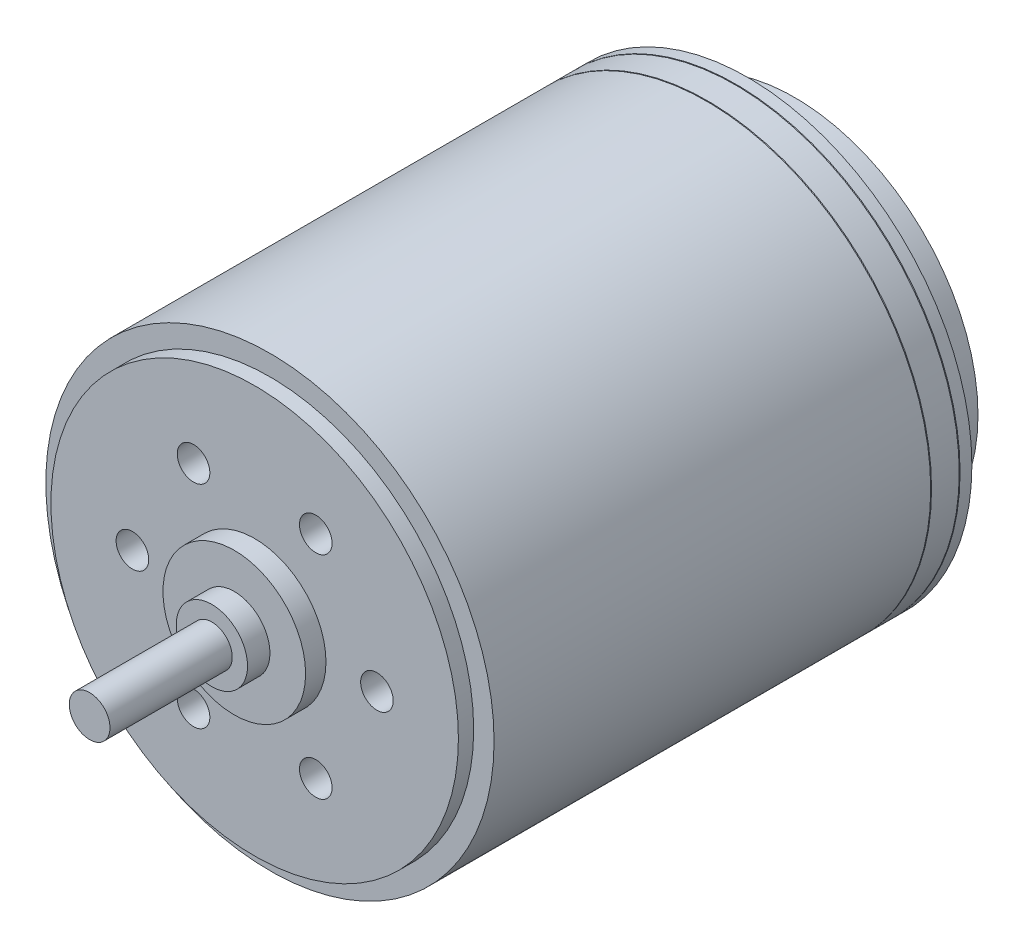
ISO-10303-21;
HEADER;
FILE_DESCRIPTION(('STEP AP214'),'2;1');
FILE_NAME('part.step','',(''),(''),'','','');
FILE_SCHEMA(('AUTOMOTIVE_DESIGN { 1 0 10303 214 1 1 1 1 }'));
ENDSEC;
DATA;
#1=APPLICATION_CONTEXT('core data for automotive mechanical design processes');
#2=APPLICATION_PROTOCOL_DEFINITION('international standard','automotive_design',2000,#1);
#3=PRODUCT_CONTEXT('',#1,'mechanical');
#4=PRODUCT('Part','Part','',(#3));
#5=PRODUCT_RELATED_PRODUCT_CATEGORY('part','',(#4));
#6=PRODUCT_DEFINITION_FORMATION('','',#4);
#7=PRODUCT_DEFINITION_CONTEXT('part definition',#1,'design');
#8=PRODUCT_DEFINITION('design','',#6,#7);
#9=PRODUCT_DEFINITION_SHAPE('','',#8);
#10=(LENGTH_UNIT() NAMED_UNIT(*) SI_UNIT(.MILLI.,.METRE.));
#11=(NAMED_UNIT(*) PLANE_ANGLE_UNIT() SI_UNIT($,.RADIAN.));
#12=(NAMED_UNIT(*) SI_UNIT($,.STERADIAN.) SOLID_ANGLE_UNIT());
#13=UNCERTAINTY_MEASURE_WITH_UNIT(LENGTH_MEASURE(1.E-05),#10,'distance_accuracy_value','');
#14=(GEOMETRIC_REPRESENTATION_CONTEXT(3) GLOBAL_UNCERTAINTY_ASSIGNED_CONTEXT((#13)) GLOBAL_UNIT_ASSIGNED_CONTEXT((#10,
#11,#12)) REPRESENTATION_CONTEXT('',''));
#15=CARTESIAN_POINT('',(0.,0.,0.));
#16=DIRECTION('',(0.,0.,1.));
#17=DIRECTION('',(1.,0.,0.));
#18=AXIS2_PLACEMENT_3D('',#15,#16,#17);
#19=CARTESIAN_POINT('',(11.,0.,0.));
#20=DIRECTION('',(0.,0.,-1.));
#21=DIRECTION('',(-1.,0.,0.));
#22=AXIS2_PLACEMENT_3D('',#19,#20,#21);
#23=PLANE('',#22);
#24=CARTESIAN_POINT('',(0.,0.,0.));
#25=DIRECTION('',(0.,0.,1.));
#26=DIRECTION('',(1.,0.,0.));
#27=AXIS2_PLACEMENT_3D('',#24,#25,#26);
#28=CIRCLE('',#27,11.);
#29=CARTESIAN_POINT('',(11.,0.,0.));
#30=VERTEX_POINT('',#29);
#31=EDGE_CURVE('E11',#30,#30,#28,.T.);
#32=ORIENTED_EDGE('',*,*,#31,.F.);
#33=EDGE_LOOP('',(#32));
#34=FACE_BOUND('',#33,.T.);
#35=CARTESIAN_POINT('',(0.,0.,0.));
#36=DIRECTION('',(0.,0.,-1.));
#37=DIRECTION('',(-1.,0.,0.));
#38=AXIS2_PLACEMENT_3D('',#35,#36,#37);
#39=CIRCLE('',#38,9.);
#40=CARTESIAN_POINT('',(-9.,0.,0.));
#41=VERTEX_POINT('',#40);
#42=EDGE_CURVE('E466',#41,#41,#39,.T.);
#43=ORIENTED_EDGE('',*,*,#42,.F.);
#44=EDGE_LOOP('',(#43));
#45=FACE_BOUND('',#44,.T.);
#46=ADVANCED_FACE('F36',(#34,#45),#23,.T.);
#47=CARTESIAN_POINT('',(0.,0.,26.3));
#48=DIRECTION('',(0.,0.,1.));
#49=DIRECTION('',(1.,0.,0.));
#50=AXIS2_PLACEMENT_3D('',#47,#48,#49);
#51=PLANE('',#50);
#52=CARTESIAN_POINT('',(0.,0.,26.3));
#53=DIRECTION('',(0.,0.,1.));
#54=DIRECTION('',(1.,0.,0.));
#55=AXIS2_PLACEMENT_3D('',#52,#53,#54);
#56=CIRCLE('',#55,1.75000000000001);
#57=CARTESIAN_POINT('',(1.75000000000004,0.,26.3));
#58=VERTEX_POINT('',#57);
#59=EDGE_CURVE('E117',#58,#58,#56,.T.);
#60=ORIENTED_EDGE('',*,*,#59,.T.);
#61=EDGE_LOOP('',(#60));
#62=FACE_BOUND('',#61,.T.);
#63=CARTESIAN_POINT('',(0.,0.,26.3));
#64=DIRECTION('',(0.,0.,1.));
#65=DIRECTION('',(1.,0.,0.));
#66=AXIS2_PLACEMENT_3D('',#63,#64,#65);
#67=CIRCLE('',#66,1.);
#68=CARTESIAN_POINT('',(1.00000000000004,0.,26.3));
#69=VERTEX_POINT('',#68);
#70=EDGE_CURVE('E110',#69,#69,#67,.T.);
#71=ORIENTED_EDGE('',*,*,#70,.F.);
#72=EDGE_LOOP('',(#71));
#73=FACE_BOUND('',#72,.T.);
#74=ADVANCED_FACE('F172',(#62,#73),#51,.T.);
#75=CARTESIAN_POINT('',(0.,0.,25.2));
#76=DIRECTION('',(0.,0.,1.));
#77=DIRECTION('',(1.,0.,0.));
#78=AXIS2_PLACEMENT_3D('',#75,#76,#77);
#79=PLANE('',#78);
#80=CARTESIAN_POINT('',(0.,0.,25.2));
#81=DIRECTION('',(0.,0.,1.));
#82=DIRECTION('',(1.,0.,0.));
#83=AXIS2_PLACEMENT_3D('',#80,#81,#82);
#84=CIRCLE('',#83,3.5);
#85=CARTESIAN_POINT('',(3.50000000000004,0.,25.2));
#86=VERTEX_POINT('',#85);
#87=EDGE_CURVE('E123',#86,#86,#84,.T.);
#88=ORIENTED_EDGE('',*,*,#87,.T.);
#89=EDGE_LOOP('',(#88));
#90=FACE_BOUND('',#89,.T.);
#91=CARTESIAN_POINT('',(0.,0.,25.2));
#92=DIRECTION('',(0.,0.,1.));
#93=DIRECTION('',(1.,0.,0.));
#94=AXIS2_PLACEMENT_3D('',#91,#92,#93);
#95=CIRCLE('',#94,1.75000000000001);
#96=CARTESIAN_POINT('',(1.75000000000004,0.,25.2));
#97=VERTEX_POINT('',#96);
#98=EDGE_CURVE('E114',#97,#97,#95,.T.);
#99=ORIENTED_EDGE('',*,*,#98,.F.);
#100=EDGE_LOOP('',(#99));
#101=FACE_BOUND('',#100,.T.);
#102=ADVANCED_FACE('F177',(#90,#101),#79,.T.);
#103=CARTESIAN_POINT('',(0.,0.,24.2));
#104=DIRECTION('',(0.,0.,1.));
#105=DIRECTION('',(1.,0.,0.));
#106=AXIS2_PLACEMENT_3D('',#103,#104,#105);
#107=PLANE('',#106);
#108=CARTESIAN_POINT('',(-2.99999999999998,5.19615242270661,24.2));
#109=DIRECTION('',(0.,0.,1.));
#110=DIRECTION('',(1.,0.,0.));
#111=AXIS2_PLACEMENT_3D('',#108,#109,#110);
#112=CIRCLE('',#111,0.799999999999988);
#113=CARTESIAN_POINT('',(-2.19999999999999,5.19615242270661,24.2));
#114=VERTEX_POINT('',#113);
#115=EDGE_CURVE('E74',#114,#114,#112,.T.);
#116=ORIENTED_EDGE('',*,*,#115,.F.);
#117=EDGE_LOOP('',(#116));
#118=FACE_BOUND('',#117,.T.);
#119=CARTESIAN_POINT('',(2.99999999999999,5.19615242270661,24.2));
#120=DIRECTION('',(0.,0.,1.));
#121=DIRECTION('',(1.,0.,0.));
#122=AXIS2_PLACEMENT_3D('',#119,#120,#121);
#123=CIRCLE('',#122,0.799999999999988);
#124=CARTESIAN_POINT('',(3.79999999999998,5.19615242270661,24.2));
#125=VERTEX_POINT('',#124);
#126=EDGE_CURVE('E73',#125,#125,#123,.T.);
#127=ORIENTED_EDGE('',*,*,#126,.F.);
#128=EDGE_LOOP('',(#127));
#129=FACE_BOUND('',#128,.T.);
#130=CARTESIAN_POINT('',(5.99999999999997,0.,24.2));
#131=DIRECTION('',(0.,0.,1.));
#132=DIRECTION('',(1.,0.,0.));
#133=AXIS2_PLACEMENT_3D('',#130,#131,#132);
#134=CIRCLE('',#133,0.799999999999988);
#135=CARTESIAN_POINT('',(6.79999999999996,0.,24.2));
#136=VERTEX_POINT('',#135);
#137=EDGE_CURVE('E86',#136,#136,#134,.T.);
#138=ORIENTED_EDGE('',*,*,#137,.F.);
#139=EDGE_LOOP('',(#138));
#140=FACE_BOUND('',#139,.T.);
#141=CARTESIAN_POINT('',(2.99999999999998,-5.1961524227066,24.2));
#142=DIRECTION('',(0.,0.,1.));
#143=DIRECTION('',(1.,0.,0.));
#144=AXIS2_PLACEMENT_3D('',#141,#142,#143);
#145=CIRCLE('',#144,0.799999999999988);
#146=CARTESIAN_POINT('',(3.79999999999997,-5.1961524227066,24.2));
#147=VERTEX_POINT('',#146);
#148=EDGE_CURVE('E92',#147,#147,#145,.T.);
#149=ORIENTED_EDGE('',*,*,#148,.F.);
#150=EDGE_LOOP('',(#149));
#151=FACE_BOUND('',#150,.T.);
#152=CARTESIAN_POINT('',(-2.99999999999998,-5.19615242270661,24.2));
#153=DIRECTION('',(0.,0.,1.));
#154=DIRECTION('',(1.,0.,0.));
#155=AXIS2_PLACEMENT_3D('',#152,#153,#154);
#156=CIRCLE('',#155,0.799999999999988);
#157=CARTESIAN_POINT('',(-2.19999999999999,-5.19615242270661,24.2));
#158=VERTEX_POINT('',#157);
#159=EDGE_CURVE('E98',#158,#158,#156,.T.);
#160=ORIENTED_EDGE('',*,*,#159,.F.);
#161=EDGE_LOOP('',(#160));
#162=FACE_BOUND('',#161,.T.);
#163=CARTESIAN_POINT('',(-5.99999999999997,0.,24.2));
#164=DIRECTION('',(0.,0.,1.));
#165=DIRECTION('',(1.,0.,0.));
#166=AXIS2_PLACEMENT_3D('',#163,#164,#165);
#167=CIRCLE('',#166,0.799999999999988);
#168=CARTESIAN_POINT('',(-5.19999999999998,0.,24.2));
#169=VERTEX_POINT('',#168);
#170=EDGE_CURVE('E104',#169,#169,#167,.T.);
#171=ORIENTED_EDGE('',*,*,#170,.F.);
#172=EDGE_LOOP('',(#171));
#173=FACE_BOUND('',#172,.T.);
#174=CARTESIAN_POINT('',(0.,0.,24.2));
#175=DIRECTION('',(0.,0.,1.));
#176=DIRECTION('',(1.,0.,0.));
#177=AXIS2_PLACEMENT_3D('',#174,#175,#176);
#178=CIRCLE('',#177,9.99999999999999);
#179=CARTESIAN_POINT('',(10.,0.,24.2));
#180=VERTEX_POINT('',#179);
#181=EDGE_CURVE('E129',#180,#180,#178,.T.);
#182=ORIENTED_EDGE('',*,*,#181,.T.);
#183=EDGE_LOOP('',(#182));
#184=FACE_BOUND('',#183,.T.);
#185=CARTESIAN_POINT('',(0.,0.,24.2));
#186=DIRECTION('',(0.,0.,1.));
#187=DIRECTION('',(1.,0.,0.));
#188=AXIS2_PLACEMENT_3D('',#185,#186,#187);
#189=CIRCLE('',#188,3.5);
#190=CARTESIAN_POINT('',(3.50000000000004,0.,24.2));
#191=VERTEX_POINT('',#190);
#192=EDGE_CURVE('E120',#191,#191,#189,.T.);
#193=ORIENTED_EDGE('',*,*,#192,.F.);
#194=EDGE_LOOP('',(#193));
#195=FACE_BOUND('',#194,.T.);
#196=ADVANCED_FACE('F183',(#118,#129,#140,#151,#162,#173,#184,#195),#107,.T.);
#197=CARTESIAN_POINT('',(0.,0.,23.45));
#198=DIRECTION('',(0.,0.,1.));
#199=DIRECTION('',(1.,0.,0.));
#200=AXIS2_PLACEMENT_3D('',#197,#198,#199);
#201=PLANE('',#200);
#202=CARTESIAN_POINT('',(0.,0.,23.45));
#203=DIRECTION('',(0.,0.,1.));
#204=DIRECTION('',(1.,0.,0.));
#205=AXIS2_PLACEMENT_3D('',#202,#203,#204);
#206=CIRCLE('',#205,11.);
#207=CARTESIAN_POINT('',(11.,0.,23.45));
#208=VERTEX_POINT('',#207);
#209=EDGE_CURVE('E44',#208,#208,#206,.T.);
#210=ORIENTED_EDGE('',*,*,#209,.T.);
#211=EDGE_LOOP('',(#210));
#212=FACE_BOUND('',#211,.T.);
#213=CARTESIAN_POINT('',(0.,0.,23.45));
#214=DIRECTION('',(0.,0.,1.));
#215=DIRECTION('',(1.,0.,0.));
#216=AXIS2_PLACEMENT_3D('',#213,#214,#215);
#217=CIRCLE('',#216,9.99999999999999);
#218=CARTESIAN_POINT('',(10.,0.,23.45));
#219=VERTEX_POINT('',#218);
#220=EDGE_CURVE('E126',#219,#219,#217,.T.);
#221=ORIENTED_EDGE('',*,*,#220,.F.);
#222=EDGE_LOOP('',(#221));
#223=FACE_BOUND('',#222,.T.);
#224=ADVANCED_FACE('F154',(#212,#223),#201,.T.);
#225=CARTESIAN_POINT('',(0.,0.,0.));
#226=DIRECTION('',(0.,0.,1.));
#227=DIRECTION('',(1.,0.,0.));
#228=AXIS2_PLACEMENT_3D('',#225,#226,#227);
#229=CYLINDRICAL_SURFACE('',#228,11.);
#230=ORIENTED_EDGE('',*,*,#31,.T.);
#231=EDGE_LOOP('',(#230));
#232=FACE_BOUND('',#231,.T.);
#233=CARTESIAN_POINT('',(0.,0.,0.579289321881336));
#234=DIRECTION('',(0.,0.,1.));
#235=DIRECTION('',(1.,0.,0.));
#236=AXIS2_PLACEMENT_3D('',#233,#234,#235);
#237=CIRCLE('',#236,11.);
#238=CARTESIAN_POINT('',(11.,0.,0.579289321881329));
#239=VERTEX_POINT('',#238);
#240=EDGE_CURVE('E132',#239,#239,#237,.T.);
#241=ORIENTED_EDGE('',*,*,#240,.F.);
#242=EDGE_LOOP('',(#241));
#243=FACE_BOUND('',#242,.T.);
#244=ADVANCED_FACE('F38',(#232,#243),#229,.T.);
#245=CARTESIAN_POINT('',(0.,0.,0.));
#246=DIRECTION('',(0.,0.,1.));
#247=DIRECTION('',(1.,0.,0.));
#248=AXIS2_PLACEMENT_3D('',#245,#246,#247);
#249=CYLINDRICAL_SURFACE('',#248,11.);
#250=CARTESIAN_POINT('',(0.,0.,2.02071067811864));
#251=DIRECTION('',(0.,0.,1.));
#252=DIRECTION('',(1.,0.,0.));
#253=AXIS2_PLACEMENT_3D('',#250,#251,#252);
#254=CIRCLE('',#253,11.);
#255=CARTESIAN_POINT('',(11.,0.,2.02071067811864));
#256=VERTEX_POINT('',#255);
#257=EDGE_CURVE('E149',#256,#256,#254,.T.);
#258=ORIENTED_EDGE('',*,*,#257,.T.);
#259=EDGE_LOOP('',(#258));
#260=FACE_BOUND('',#259,.T.);
#261=ORIENTED_EDGE('',*,*,#209,.F.);
#262=EDGE_LOOP('',(#261));
#263=FACE_BOUND('',#262,.T.);
#264=ADVANCED_FACE('F157',(#260,#263),#249,.T.);
#265=CARTESIAN_POINT('',(0.,0.,2.02071067811864));
#266=DIRECTION('',(0.,0.,1.));
#267=DIRECTION('',(1.,0.,0.));
#268=AXIS2_PLACEMENT_3D('',#265,#266,#267);
#269=CONICAL_SURFACE('',#268,11.,1.17809724509615);
#270=CARTESIAN_POINT('',(0.,0.,1.99999999999999));
#271=DIRECTION('',(0.,0.,1.));
#272=DIRECTION('',(1.,0.,0.));
#273=AXIS2_PLACEMENT_3D('',#270,#271,#272);
#274=CIRCLE('',#273,10.95);
#275=CARTESIAN_POINT('',(10.95,0.,1.99999999999998));
#276=VERTEX_POINT('',#275);
#277=EDGE_CURVE('E146',#276,#276,#274,.T.);
#278=ORIENTED_EDGE('',*,*,#277,.T.);
#279=EDGE_LOOP('',(#278));
#280=FACE_BOUND('',#279,.T.);
#281=ORIENTED_EDGE('',*,*,#257,.F.);
#282=EDGE_LOOP('',(#281));
#283=FACE_BOUND('',#282,.T.);
#284=ADVANCED_FACE('F159',(#280,#283),#269,.T.);
#285=CARTESIAN_POINT('',(0.,0.,1.99999999999999));
#286=DIRECTION('',(0.,0.,-1.));
#287=DIRECTION('',(-1.,0.,0.));
#288=AXIS2_PLACEMENT_3D('',#285,#286,#287);
#289=CONICAL_SURFACE('',#288,10.95,1.17809724509619);
#290=CARTESIAN_POINT('',(0.,0.,1.97928932188133));
#291=DIRECTION('',(0.,0.,1.));
#292=DIRECTION('',(1.,0.,0.));
#293=AXIS2_PLACEMENT_3D('',#290,#291,#292);
#294=CIRCLE('',#293,11.);
#295=CARTESIAN_POINT('',(11.,0.,1.97928932188133));
#296=VERTEX_POINT('',#295);
#297=EDGE_CURVE('E143',#296,#296,#294,.T.);
#298=ORIENTED_EDGE('',*,*,#297,.T.);
#299=EDGE_LOOP('',(#298));
#300=FACE_BOUND('',#299,.T.);
#301=ORIENTED_EDGE('',*,*,#277,.F.);
#302=EDGE_LOOP('',(#301));
#303=FACE_BOUND('',#302,.T.);
#304=ADVANCED_FACE('F166',(#300,#303),#289,.T.);
#305=CARTESIAN_POINT('',(0.,0.,0.));
#306=DIRECTION('',(0.,0.,1.));
#307=DIRECTION('',(1.,0.,0.));
#308=AXIS2_PLACEMENT_3D('',#305,#306,#307);
#309=CYLINDRICAL_SURFACE('',#308,11.);
#310=CARTESIAN_POINT('',(0.,0.,0.620710678118649));
#311=DIRECTION('',(0.,0.,1.));
#312=DIRECTION('',(1.,0.,0.));
#313=AXIS2_PLACEMENT_3D('',#310,#311,#312);
#314=CIRCLE('',#313,11.);
#315=CARTESIAN_POINT('',(11.,0.,0.620710678118642));
#316=VERTEX_POINT('',#315);
#317=EDGE_CURVE('E140',#316,#316,#314,.T.);
#318=ORIENTED_EDGE('',*,*,#317,.T.);
#319=EDGE_LOOP('',(#318));
#320=FACE_BOUND('',#319,.T.);
#321=ORIENTED_EDGE('',*,*,#297,.F.);
#322=EDGE_LOOP('',(#321));
#323=FACE_BOUND('',#322,.T.);
#324=ADVANCED_FACE('F210',(#320,#323),#309,.T.);
#325=CARTESIAN_POINT('',(0.,0.,0.620710678118649));
#326=DIRECTION('',(0.,0.,1.));
#327=DIRECTION('',(1.,0.,0.));
#328=AXIS2_PLACEMENT_3D('',#325,#326,#327);
#329=CONICAL_SURFACE('',#328,11.,1.17809724509613);
#330=CARTESIAN_POINT('',(0.,0.,0.599999999999992));
#331=DIRECTION('',(0.,0.,1.));
#332=DIRECTION('',(1.,0.,0.));
#333=AXIS2_PLACEMENT_3D('',#330,#331,#332);
#334=CIRCLE('',#333,10.95);
#335=CARTESIAN_POINT('',(10.95,0.,0.599999999999984));
#336=VERTEX_POINT('',#335);
#337=EDGE_CURVE('E137',#336,#336,#334,.T.);
#338=ORIENTED_EDGE('',*,*,#337,.T.);
#339=EDGE_LOOP('',(#338));
#340=FACE_BOUND('',#339,.T.);
#341=ORIENTED_EDGE('',*,*,#317,.F.);
#342=EDGE_LOOP('',(#341));
#343=FACE_BOUND('',#342,.T.);
#344=ADVANCED_FACE('F206',(#340,#343),#329,.T.);
#345=CARTESIAN_POINT('',(0.,0.,0.599999999999992));
#346=DIRECTION('',(0.,0.,-1.));
#347=DIRECTION('',(-1.,0.,0.));
#348=AXIS2_PLACEMENT_3D('',#345,#346,#347);
#349=CONICAL_SURFACE('',#348,10.95,1.17809724509616);
#350=ORIENTED_EDGE('',*,*,#240,.T.);
#351=EDGE_LOOP('',(#350));
#352=FACE_BOUND('',#351,.T.);
#353=ORIENTED_EDGE('',*,*,#337,.F.);
#354=EDGE_LOOP('',(#353));
#355=FACE_BOUND('',#354,.T.);
#356=ADVANCED_FACE('F202',(#352,#355),#349,.T.);
#357=CARTESIAN_POINT('',(0.,0.,24.2));
#358=DIRECTION('',(0.,0.,-1.));
#359=DIRECTION('',(-1.,0.,0.));
#360=AXIS2_PLACEMENT_3D('',#357,#358,#359);
#361=CYLINDRICAL_SURFACE('',#360,9.99999999999999);
#362=ORIENTED_EDGE('',*,*,#181,.F.);
#363=EDGE_LOOP('',(#362));
#364=FACE_BOUND('',#363,.T.);
#365=ORIENTED_EDGE('',*,*,#220,.T.);
#366=EDGE_LOOP('',(#365));
#367=FACE_BOUND('',#366,.T.);
#368=ADVANCED_FACE('F199',(#364,#367),#361,.T.);
#369=CARTESIAN_POINT('',(0.,0.,25.2));
#370=DIRECTION('',(0.,0.,-1.));
#371=DIRECTION('',(-1.,0.,0.));
#372=AXIS2_PLACEMENT_3D('',#369,#370,#371);
#373=CYLINDRICAL_SURFACE('',#372,3.5);
#374=ORIENTED_EDGE('',*,*,#87,.F.);
#375=EDGE_LOOP('',(#374));
#376=FACE_BOUND('',#375,.T.);
#377=ORIENTED_EDGE('',*,*,#192,.T.);
#378=EDGE_LOOP('',(#377));
#379=FACE_BOUND('',#378,.T.);
#380=ADVANCED_FACE('F198',(#376,#379),#373,.T.);
#381=CARTESIAN_POINT('',(0.,0.,26.3));
#382=DIRECTION('',(0.,0.,-1.));
#383=DIRECTION('',(-1.,0.,0.));
#384=AXIS2_PLACEMENT_3D('',#381,#382,#383);
#385=CYLINDRICAL_SURFACE('',#384,1.75000000000001);
#386=ORIENTED_EDGE('',*,*,#59,.F.);
#387=EDGE_LOOP('',(#386));
#388=FACE_BOUND('',#387,.T.);
#389=ORIENTED_EDGE('',*,*,#98,.T.);
#390=EDGE_LOOP('',(#389));
#391=FACE_BOUND('',#390,.T.);
#392=ADVANCED_FACE('F249',(#388,#391),#385,.T.);
#393=CARTESIAN_POINT('',(0.,0.,32.3));
#394=DIRECTION('',(0.,0.,-1.));
#395=DIRECTION('',(-1.,0.,0.));
#396=AXIS2_PLACEMENT_3D('',#393,#394,#395);
#397=CYLINDRICAL_SURFACE('',#396,1.);
#398=CARTESIAN_POINT('',(0.,0.,32.3));
#399=DIRECTION('',(0.,0.,1.));
#400=DIRECTION('',(1.,0.,0.));
#401=AXIS2_PLACEMENT_3D('',#398,#399,#400);
#402=CIRCLE('',#401,1.);
#403=CARTESIAN_POINT('',(1.00000000000004,0.,32.3));
#404=VERTEX_POINT('',#403);
#405=EDGE_CURVE('E111',#404,#404,#402,.T.);
#406=ORIENTED_EDGE('',*,*,#405,.F.);
#407=EDGE_LOOP('',(#406));
#408=FACE_BOUND('',#407,.T.);
#409=ORIENTED_EDGE('',*,*,#70,.T.);
#410=EDGE_LOOP('',(#409));
#411=FACE_BOUND('',#410,.T.);
#412=ADVANCED_FACE('F257',(#408,#411),#397,.T.);
#413=CARTESIAN_POINT('',(0.,0.,32.3));
#414=DIRECTION('',(0.,0.,1.));
#415=DIRECTION('',(1.,0.,0.));
#416=AXIS2_PLACEMENT_3D('',#413,#414,#415);
#417=PLANE('',#416);
#418=ORIENTED_EDGE('',*,*,#405,.T.);
#419=EDGE_LOOP('',(#418));
#420=FACE_BOUND('',#419,.T.);
#421=ADVANCED_FACE('F266',(#420),#417,.T.);
#422=CARTESIAN_POINT('',(-5.99999999999997,0.,19.7));
#423=DIRECTION('',(0.,0.,1.));
#424=DIRECTION('',(1.,0.,0.));
#425=AXIS2_PLACEMENT_3D('',#422,#423,#424);
#426=CONICAL_SURFACE('',#425,0.799999999999986,1.02974425867669);
#427=CARTESIAN_POINT('',(-5.99999999999997,0.,19.219311504778));
#428=VERTEX_POINT('',#427);
#429=VERTEX_LOOP('',#428);
#430=FACE_BOUND('',#429,.T.);
#431=CARTESIAN_POINT('',(-5.99999999999997,0.,19.7));
#432=DIRECTION('',(0.,0.,1.));
#433=DIRECTION('',(1.,0.,0.));
#434=AXIS2_PLACEMENT_3D('',#431,#432,#433);
#435=CIRCLE('',#434,0.799999999999986);
#436=CARTESIAN_POINT('',(-5.19999999999998,0.,19.7));
#437=VERTEX_POINT('',#436);
#438=EDGE_CURVE('E107',#437,#437,#435,.T.);
#439=ORIENTED_EDGE('',*,*,#438,.T.);
#440=EDGE_LOOP('',(#439));
#441=FACE_BOUND('',#440,.T.);
#442=ADVANCED_FACE('F274',(#430,#441),#426,.F.);
#443=CARTESIAN_POINT('',(-5.99999999999997,0.,24.2));
#444=DIRECTION('',(0.,0.,1.));
#445=DIRECTION('',(1.,0.,0.));
#446=AXIS2_PLACEMENT_3D('',#443,#444,#445);
#447=CYLINDRICAL_SURFACE('',#446,0.799999999999987);
#448=ORIENTED_EDGE('',*,*,#438,.F.);
#449=EDGE_LOOP('',(#448));
#450=FACE_BOUND('',#449,.T.);
#451=ORIENTED_EDGE('',*,*,#170,.T.);
#452=EDGE_LOOP('',(#451));
#453=FACE_BOUND('',#452,.T.);
#454=ADVANCED_FACE('F282',(#450,#453),#447,.F.);
#455=CARTESIAN_POINT('',(-2.99999999999998,-5.19615242270661,19.7));
#456=DIRECTION('',(0.,0.,1.));
#457=DIRECTION('',(1.,0.,0.));
#458=AXIS2_PLACEMENT_3D('',#455,#456,#457);
#459=CONICAL_SURFACE('',#458,0.799999999999986,1.02974425867669);
#460=CARTESIAN_POINT('',(-2.99999999999998,-5.19615242270661,19.219311504778));
#461=VERTEX_POINT('',#460);
#462=VERTEX_LOOP('',#461);
#463=FACE_BOUND('',#462,.T.);
#464=CARTESIAN_POINT('',(-2.99999999999998,-5.19615242270661,19.7));
#465=DIRECTION('',(0.,0.,1.));
#466=DIRECTION('',(1.,0.,0.));
#467=AXIS2_PLACEMENT_3D('',#464,#465,#466);
#468=CIRCLE('',#467,0.799999999999986);
#469=CARTESIAN_POINT('',(-2.19999999999999,-5.19615242270661,19.7));
#470=VERTEX_POINT('',#469);
#471=EDGE_CURVE('E101',#470,#470,#468,.T.);
#472=ORIENTED_EDGE('',*,*,#471,.T.);
#473=EDGE_LOOP('',(#472));
#474=FACE_BOUND('',#473,.T.);
#475=ADVANCED_FACE('F289',(#463,#474),#459,.F.);
#476=CARTESIAN_POINT('',(-2.99999999999998,-5.19615242270661,24.2));
#477=DIRECTION('',(0.,0.,1.));
#478=DIRECTION('',(1.,0.,0.));
#479=AXIS2_PLACEMENT_3D('',#476,#477,#478);
#480=CYLINDRICAL_SURFACE('',#479,0.799999999999987);
#481=ORIENTED_EDGE('',*,*,#471,.F.);
#482=EDGE_LOOP('',(#481));
#483=FACE_BOUND('',#482,.T.);
#484=ORIENTED_EDGE('',*,*,#159,.T.);
#485=EDGE_LOOP('',(#484));
#486=FACE_BOUND('',#485,.T.);
#487=ADVANCED_FACE('F297',(#483,#486),#480,.F.);
#488=CARTESIAN_POINT('',(2.99999999999998,-5.1961524227066,19.7));
#489=DIRECTION('',(0.,0.,1.));
#490=DIRECTION('',(1.,0.,0.));
#491=AXIS2_PLACEMENT_3D('',#488,#489,#490);
#492=CONICAL_SURFACE('',#491,0.799999999999986,1.02974425867669);
#493=CARTESIAN_POINT('',(2.99999999999998,-5.1961524227066,19.219311504778));
#494=VERTEX_POINT('',#493);
#495=VERTEX_LOOP('',#494);
#496=FACE_BOUND('',#495,.T.);
#497=CARTESIAN_POINT('',(2.99999999999998,-5.1961524227066,19.7));
#498=DIRECTION('',(0.,0.,1.));
#499=DIRECTION('',(1.,0.,0.));
#500=AXIS2_PLACEMENT_3D('',#497,#498,#499);
#501=CIRCLE('',#500,0.799999999999986);
#502=CARTESIAN_POINT('',(3.79999999999997,-5.1961524227066,19.7));
#503=VERTEX_POINT('',#502);
#504=EDGE_CURVE('E95',#503,#503,#501,.T.);
#505=ORIENTED_EDGE('',*,*,#504,.T.);
#506=EDGE_LOOP('',(#505));
#507=FACE_BOUND('',#506,.T.);
#508=ADVANCED_FACE('F304',(#496,#507),#492,.F.);
#509=CARTESIAN_POINT('',(2.99999999999998,-5.1961524227066,24.2));
#510=DIRECTION('',(0.,0.,1.));
#511=DIRECTION('',(1.,0.,0.));
#512=AXIS2_PLACEMENT_3D('',#509,#510,#511);
#513=CYLINDRICAL_SURFACE('',#512,0.799999999999987);
#514=ORIENTED_EDGE('',*,*,#504,.F.);
#515=EDGE_LOOP('',(#514));
#516=FACE_BOUND('',#515,.T.);
#517=ORIENTED_EDGE('',*,*,#148,.T.);
#518=EDGE_LOOP('',(#517));
#519=FACE_BOUND('',#518,.T.);
#520=ADVANCED_FACE('F312',(#516,#519),#513,.F.);
#521=CARTESIAN_POINT('',(5.99999999999997,0.,19.7));
#522=DIRECTION('',(0.,0.,1.));
#523=DIRECTION('',(1.,0.,0.));
#524=AXIS2_PLACEMENT_3D('',#521,#522,#523);
#525=CONICAL_SURFACE('',#524,0.799999999999986,1.02974425867669);
#526=CARTESIAN_POINT('',(5.99999999999997,0.,19.219311504778));
#527=VERTEX_POINT('',#526);
#528=VERTEX_LOOP('',#527);
#529=FACE_BOUND('',#528,.T.);
#530=CARTESIAN_POINT('',(5.99999999999997,0.,19.7));
#531=DIRECTION('',(0.,0.,1.));
#532=DIRECTION('',(1.,0.,0.));
#533=AXIS2_PLACEMENT_3D('',#530,#531,#532);
#534=CIRCLE('',#533,0.799999999999986);
#535=CARTESIAN_POINT('',(6.79999999999996,0.,19.7));
#536=VERTEX_POINT('',#535);
#537=EDGE_CURVE('E89',#536,#536,#534,.T.);
#538=ORIENTED_EDGE('',*,*,#537,.T.);
#539=EDGE_LOOP('',(#538));
#540=FACE_BOUND('',#539,.T.);
#541=ADVANCED_FACE('F320',(#529,#540),#525,.F.);
#542=CARTESIAN_POINT('',(5.99999999999997,0.,24.2));
#543=DIRECTION('',(0.,0.,1.));
#544=DIRECTION('',(1.,0.,0.));
#545=AXIS2_PLACEMENT_3D('',#542,#543,#544);
#546=CYLINDRICAL_SURFACE('',#545,0.799999999999987);
#547=ORIENTED_EDGE('',*,*,#537,.F.);
#548=EDGE_LOOP('',(#547));
#549=FACE_BOUND('',#548,.T.);
#550=ORIENTED_EDGE('',*,*,#137,.T.);
#551=EDGE_LOOP('',(#550));
#552=FACE_BOUND('',#551,.T.);
#553=ADVANCED_FACE('F328',(#549,#552),#546,.F.);
#554=CARTESIAN_POINT('',(2.99999999999999,5.19615242270661,19.7));
#555=DIRECTION('',(0.,0.,1.));
#556=DIRECTION('',(1.,0.,0.));
#557=AXIS2_PLACEMENT_3D('',#554,#555,#556);
#558=CONICAL_SURFACE('',#557,0.799999999999986,1.02974425867669);
#559=CARTESIAN_POINT('',(2.99999999999999,5.19615242270661,19.219311504778));
#560=VERTEX_POINT('',#559);
#561=VERTEX_LOOP('',#560);
#562=FACE_BOUND('',#561,.T.);
#563=CARTESIAN_POINT('',(2.99999999999999,5.19615242270661,19.7));
#564=DIRECTION('',(0.,0.,1.));
#565=DIRECTION('',(1.,0.,0.));
#566=AXIS2_PLACEMENT_3D('',#563,#564,#565);
#567=CIRCLE('',#566,0.799999999999986);
#568=CARTESIAN_POINT('',(3.79999999999998,5.19615242270661,19.7));
#569=VERTEX_POINT('',#568);
#570=EDGE_CURVE('E77',#569,#569,#567,.T.);
#571=ORIENTED_EDGE('',*,*,#570,.T.);
#572=EDGE_LOOP('',(#571));
#573=FACE_BOUND('',#572,.T.);
#574=ADVANCED_FACE('F336',(#562,#573),#558,.F.);
#575=CARTESIAN_POINT('',(2.99999999999999,5.19615242270661,24.2));
#576=DIRECTION('',(0.,0.,1.));
#577=DIRECTION('',(1.,0.,0.));
#578=AXIS2_PLACEMENT_3D('',#575,#576,#577);
#579=CYLINDRICAL_SURFACE('',#578,0.799999999999987);
#580=ORIENTED_EDGE('',*,*,#570,.F.);
#581=EDGE_LOOP('',(#580));
#582=FACE_BOUND('',#581,.T.);
#583=ORIENTED_EDGE('',*,*,#126,.T.);
#584=EDGE_LOOP('',(#583));
#585=FACE_BOUND('',#584,.T.);
#586=ADVANCED_FACE('F67',(#582,#585),#579,.F.);
#587=CARTESIAN_POINT('',(-2.99999999999998,5.19615242270661,19.7));
#588=DIRECTION('',(0.,0.,1.));
#589=DIRECTION('',(1.,0.,0.));
#590=AXIS2_PLACEMENT_3D('',#587,#588,#589);
#591=CONICAL_SURFACE('',#590,0.799999999999986,1.02974425867669);
#592=CARTESIAN_POINT('',(-2.99999999999998,5.19615242270661,19.219311504778));
#593=VERTEX_POINT('',#592);
#594=VERTEX_LOOP('',#593);
#595=FACE_BOUND('',#594,.T.);
#596=CARTESIAN_POINT('',(-2.99999999999998,5.19615242270661,19.7));
#597=DIRECTION('',(0.,0.,1.));
#598=DIRECTION('',(1.,0.,0.));
#599=AXIS2_PLACEMENT_3D('',#596,#597,#598);
#600=CIRCLE('',#599,0.799999999999986);
#601=CARTESIAN_POINT('',(-2.19999999999999,5.19615242270661,19.7));
#602=VERTEX_POINT('',#601);
#603=EDGE_CURVE('E71',#602,#602,#600,.T.);
#604=ORIENTED_EDGE('',*,*,#603,.T.);
#605=EDGE_LOOP('',(#604));
#606=FACE_BOUND('',#605,.T.);
#607=ADVANCED_FACE('F63',(#595,#606),#591,.F.);
#608=CARTESIAN_POINT('',(-2.99999999999998,5.19615242270661,24.2));
#609=DIRECTION('',(0.,0.,1.));
#610=DIRECTION('',(1.,0.,0.));
#611=AXIS2_PLACEMENT_3D('',#608,#609,#610);
#612=CYLINDRICAL_SURFACE('',#611,0.799999999999987);
#613=ORIENTED_EDGE('',*,*,#603,.F.);
#614=EDGE_LOOP('',(#613));
#615=FACE_BOUND('',#614,.T.);
#616=ORIENTED_EDGE('',*,*,#115,.T.);
#617=EDGE_LOOP('',(#616));
#618=FACE_BOUND('',#617,.T.);
#619=ADVANCED_FACE('F66',(#615,#618),#612,.F.);
#620=CARTESIAN_POINT('',(0.,0.,-2.3));
#621=DIRECTION('',(0.,0.,1.));
#622=DIRECTION('',(1.,0.,0.));
#623=AXIS2_PLACEMENT_3D('',#620,#621,#622);
#624=CYLINDRICAL_SURFACE('',#623,9.);
#625=CARTESIAN_POINT('',(0.,0.,-2.3));
#626=DIRECTION('',(0.,0.,-1.));
#627=DIRECTION('',(-1.,0.,0.));
#628=AXIS2_PLACEMENT_3D('',#625,#626,#627);
#629=CIRCLE('',#628,9.);
#630=CARTESIAN_POINT('',(-9.,0.,-2.29999999999999));
#631=VERTEX_POINT('',#630);
#632=EDGE_CURVE('E80',#631,#631,#629,.T.);
#633=ORIENTED_EDGE('',*,*,#632,.F.);
#634=EDGE_LOOP('',(#633));
#635=FACE_BOUND('',#634,.T.);
#636=ORIENTED_EDGE('',*,*,#42,.T.);
#637=EDGE_LOOP('',(#636));
#638=FACE_BOUND('',#637,.T.);
#639=ADVANCED_FACE('F362',(#635,#638),#624,.T.);
#640=CARTESIAN_POINT('',(0.,0.,-2.3));
#641=DIRECTION('',(0.,0.,-1.));
#642=DIRECTION('',(-1.,0.,0.));
#643=AXIS2_PLACEMENT_3D('',#640,#641,#642);
#644=PLANE('',#643);
#645=ORIENTED_EDGE('',*,*,#632,.T.);
#646=EDGE_LOOP('',(#645));
#647=FACE_BOUND('',#646,.T.);
#648=ADVANCED_FACE('F369',(#647),#644,.T.);
#649=CLOSED_SHELL('',(#46,#74,#102,#196,#224,#244,#264,#284,#304,#324,#344,#356,#368,#380,#392,
#412,#421,#442,#454,#475,#487,#508,#520,#541,#553,#574,#586,#607,#619,#639,#648));
#650=MANIFOLD_SOLID_BREP('B2',#649);
#651=ADVANCED_BREP_SHAPE_REPRESENTATION('',(#18,#650),#14);
#652=SHAPE_DEFINITION_REPRESENTATION(#9,#651);
ENDSEC;
END-ISO-10303-21;
